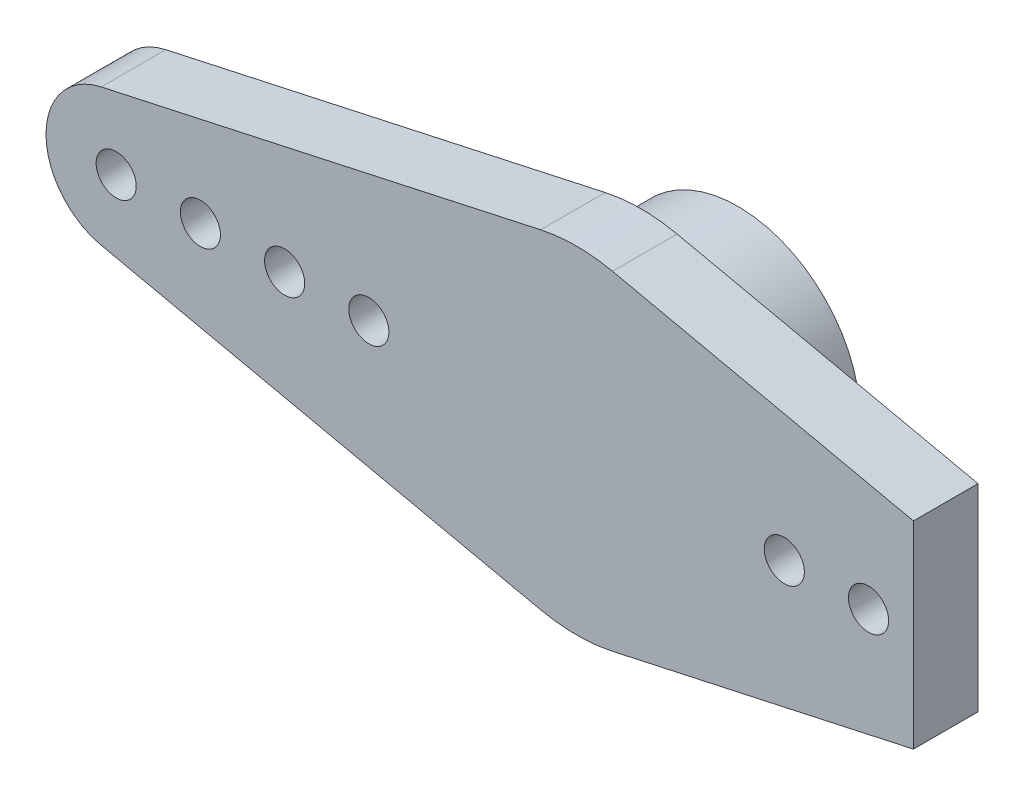
ISO-10303-21;
HEADER;
FILE_DESCRIPTION(('STEP AP214'),'2;1');
FILE_NAME('part.step','',(''),(''),'','','');
FILE_SCHEMA(('AUTOMOTIVE_DESIGN { 1 0 10303 214 1 1 1 1 }'));
ENDSEC;
DATA;
#1=APPLICATION_CONTEXT('core data for automotive mechanical design processes');
#2=APPLICATION_PROTOCOL_DEFINITION('international standard','automotive_design',2000,#1);
#3=PRODUCT_CONTEXT('',#1,'mechanical');
#4=PRODUCT('Part','Part','',(#3));
#5=PRODUCT_RELATED_PRODUCT_CATEGORY('part','',(#4));
#6=PRODUCT_DEFINITION_FORMATION('','',#4);
#7=PRODUCT_DEFINITION_CONTEXT('part definition',#1,'design');
#8=PRODUCT_DEFINITION('design','',#6,#7);
#9=PRODUCT_DEFINITION_SHAPE('','',#8);
#10=(LENGTH_UNIT() NAMED_UNIT(*) SI_UNIT(.MILLI.,.METRE.));
#11=(NAMED_UNIT(*) PLANE_ANGLE_UNIT() SI_UNIT($,.RADIAN.));
#12=(NAMED_UNIT(*) SI_UNIT($,.STERADIAN.) SOLID_ANGLE_UNIT());
#13=UNCERTAINTY_MEASURE_WITH_UNIT(LENGTH_MEASURE(1.E-05),#10,'distance_accuracy_value','');
#14=(GEOMETRIC_REPRESENTATION_CONTEXT(3) GLOBAL_UNCERTAINTY_ASSIGNED_CONTEXT((#13)) GLOBAL_UNIT_ASSIGNED_CONTEXT((#10,
#11,#12)) REPRESENTATION_CONTEXT('',''));
#15=CARTESIAN_POINT('',(0.,0.,0.));
#16=DIRECTION('',(0.,0.,1.));
#17=DIRECTION('',(1.,0.,0.));
#18=AXIS2_PLACEMENT_3D('',#15,#16,#17);
#19=CARTESIAN_POINT('',(0.,0.,3.45));
#20=DIRECTION('',(0.,0.,-1.));
#21=DIRECTION('',(-1.,0.,0.));
#22=AXIS2_PLACEMENT_3D('',#19,#20,#21);
#23=CYLINDRICAL_SURFACE('',#22,4.35);
#24=CARTESIAN_POINT('',(0.,0.,3.45));
#25=DIRECTION('',(0.,0.,1.));
#26=DIRECTION('',(1.,0.,0.));
#27=AXIS2_PLACEMENT_3D('',#24,#25,#26);
#28=CIRCLE('',#27,4.35);
#29=CARTESIAN_POINT('',(4.35,0.,3.45));
#30=VERTEX_POINT('',#29);
#31=EDGE_CURVE('E42',#30,#30,#28,.T.);
#32=ORIENTED_EDGE('',*,*,#31,.F.);
#33=EDGE_LOOP('',(#32));
#34=FACE_BOUND('',#33,.T.);
#35=CARTESIAN_POINT('',(0.,0.,0.));
#36=DIRECTION('',(0.,0.,1.));
#37=DIRECTION('',(1.,0.,0.));
#38=AXIS2_PLACEMENT_3D('',#35,#36,#37);
#39=CIRCLE('',#38,4.35);
#40=CARTESIAN_POINT('',(4.35,0.,0.));
#41=VERTEX_POINT('',#40);
#42=EDGE_CURVE('E160',#41,#41,#39,.T.);
#43=ORIENTED_EDGE('',*,*,#42,.T.);
#44=EDGE_LOOP('',(#43));
#45=FACE_BOUND('',#44,.T.);
#46=ADVANCED_FACE('F35',(#34,#45),#23,.T.);
#47=CARTESIAN_POINT('',(0.,0.,0.));
#48=DIRECTION('',(0.,0.,1.));
#49=DIRECTION('',(1.,0.,0.));
#50=AXIS2_PLACEMENT_3D('',#47,#48,#49);
#51=PLANE('',#50);
#52=CARTESIAN_POINT('',(0.,0.,0.));
#53=DIRECTION('',(0.,0.,-1.));
#54=DIRECTION('',(-1.,0.,0.));
#55=AXIS2_PLACEMENT_3D('',#52,#53,#54);
#56=CIRCLE('',#55,2.85);
#57=CARTESIAN_POINT('',(-2.85,0.,0.));
#58=VERTEX_POINT('',#57);
#59=EDGE_CURVE('E359',#58,#58,#56,.T.);
#60=ORIENTED_EDGE('',*,*,#59,.F.);
#61=EDGE_LOOP('',(#60));
#62=FACE_BOUND('',#61,.T.);
#63=ORIENTED_EDGE('',*,*,#42,.F.);
#64=EDGE_LOOP('',(#63));
#65=FACE_BOUND('',#64,.T.);
#66=ADVANCED_FACE('F166',(#62,#65),#51,.F.);
#67=CARTESIAN_POINT('',(0.,0.,5.75));
#68=DIRECTION('',(0.,0.,1.));
#69=DIRECTION('',(1.,0.,0.));
#70=AXIS2_PLACEMENT_3D('',#67,#68,#69);
#71=PLANE('',#70);
#72=DIRECTION('',(0.,-1.,0.));
#73=VECTOR('',#72,1.);
#74=CARTESIAN_POINT('',(12.,-5.85640708743976,5.75));
#75=LINE('',#74,#73);
#76=CARTESIAN_POINT('',(12.,3.52012196076709,5.75));
#77=VERTEX_POINT('',#76);
#78=CARTESIAN_POINT('',(12.,-3.5201219607671,5.75));
#79=VERTEX_POINT('',#78);
#80=EDGE_CURVE('E412',#77,#79,#75,.T.);
#81=ORIENTED_EDGE('',*,*,#80,.F.);
#82=DIRECTION('',(-0.976961715694215,0.213414634146342,0.));
#83=VECTOR('',#82,1.);
#84=CARTESIAN_POINT('',(1.28048780487805,5.86177029416529,5.75));
#85=LINE('',#84,#83);
#86=CARTESIAN_POINT('',(1.28048780487805,5.86177029416529,5.75));
#87=VERTEX_POINT('',#86);
#88=EDGE_CURVE('E57',#77,#87,#85,.T.);
#89=ORIENTED_EDGE('',*,*,#88,.T.);
#90=CARTESIAN_POINT('',(0.,0.,5.75));
#91=DIRECTION('',(0.,0.,1.));
#92=DIRECTION('',(1.,0.,0.));
#93=AXIS2_PLACEMENT_3D('',#90,#91,#92);
#94=CIRCLE('',#93,6.);
#95=CARTESIAN_POINT('',(-1.28048780487805,5.86177029416529,5.75));
#96=VERTEX_POINT('',#95);
#97=EDGE_CURVE('E151',#87,#96,#94,.T.);
#98=ORIENTED_EDGE('',*,*,#97,.T.);
#99=DIRECTION('',(-0.976961715694215,-0.213414634146342,0.));
#100=VECTOR('',#99,1.);
#101=CARTESIAN_POINT('',(-1.28048780487805,5.86177029416529,5.75));
#102=LINE('',#101,#100);
#103=CARTESIAN_POINT('',(-16.9335365853659,2.44240428923553,5.75));
#104=VERTEX_POINT('',#103);
#105=EDGE_CURVE('E93',#96,#104,#102,.T.);
#106=ORIENTED_EDGE('',*,*,#105,.T.);
#107=CARTESIAN_POINT('',(-16.4,0.,5.75));
#108=DIRECTION('',(0.,0.,1.));
#109=DIRECTION('',(1.,0.,0.));
#110=AXIS2_PLACEMENT_3D('',#107,#108,#109);
#111=CIRCLE('',#110,2.5);
#112=CARTESIAN_POINT('',(-16.9335365853659,-2.44240428923554,5.75));
#113=VERTEX_POINT('',#112);
#114=EDGE_CURVE('E111',#104,#113,#111,.T.);
#115=ORIENTED_EDGE('',*,*,#114,.T.);
#116=DIRECTION('',(0.976961715694215,-0.213414634146341,0.));
#117=VECTOR('',#116,1.);
#118=CARTESIAN_POINT('',(-1.28048780487805,-5.86177029416529,5.75));
#119=LINE('',#118,#117);
#120=CARTESIAN_POINT('',(-1.28048780487805,-5.86177029416529,5.75));
#121=VERTEX_POINT('',#120);
#122=EDGE_CURVE('E102',#113,#121,#119,.T.);
#123=ORIENTED_EDGE('',*,*,#122,.T.);
#124=CARTESIAN_POINT('',(0.,0.,5.75));
#125=DIRECTION('',(0.,0.,1.));
#126=DIRECTION('',(1.,0.,0.));
#127=AXIS2_PLACEMENT_3D('',#124,#125,#126);
#128=CIRCLE('',#127,6.);
#129=CARTESIAN_POINT('',(1.28048780487805,-5.86177029416529,5.75));
#130=VERTEX_POINT('',#129);
#131=EDGE_CURVE('E108',#121,#130,#128,.T.);
#132=ORIENTED_EDGE('',*,*,#131,.T.);
#133=DIRECTION('',(0.976961715694215,0.213414634146341,0.));
#134=VECTOR('',#133,1.);
#135=CARTESIAN_POINT('',(1.28048780487805,-5.86177029416529,5.75));
#136=LINE('',#135,#134);
#137=EDGE_CURVE('E129',#130,#79,#136,.T.);
#138=ORIENTED_EDGE('',*,*,#137,.T.);
#139=EDGE_LOOP('',(#81,#89,#98,#106,#115,#123,#132,#138));
#140=FACE_BOUND('',#139,.T.);
#141=CARTESIAN_POINT('',(7.4,0.,5.75));
#142=DIRECTION('',(0.,0.,1.));
#143=DIRECTION('',(-1.,0.,0.));
#144=AXIS2_PLACEMENT_3D('',#141,#142,#143);
#145=CIRCLE('',#144,0.715);
#146=CARTESIAN_POINT('',(6.685,0.,5.75));
#147=VERTEX_POINT('',#146);
#148=EDGE_CURVE('E373',#147,#147,#145,.T.);
#149=ORIENTED_EDGE('',*,*,#148,.F.);
#150=EDGE_LOOP('',(#149));
#151=FACE_BOUND('',#150,.T.);
#152=CARTESIAN_POINT('',(-7.4,0.,5.75));
#153=DIRECTION('',(0.,0.,1.));
#154=DIRECTION('',(1.,0.,0.));
#155=AXIS2_PLACEMENT_3D('',#152,#153,#154);
#156=CIRCLE('',#155,0.715);
#157=CARTESIAN_POINT('',(-6.685,0.,5.75));
#158=VERTEX_POINT('',#157);
#159=EDGE_CURVE('E385',#158,#158,#156,.T.);
#160=ORIENTED_EDGE('',*,*,#159,.F.);
#161=EDGE_LOOP('',(#160));
#162=FACE_BOUND('',#161,.T.);
#163=CARTESIAN_POINT('',(-16.4,0.,5.75));
#164=DIRECTION('',(0.,0.,1.));
#165=DIRECTION('',(1.,0.,0.));
#166=AXIS2_PLACEMENT_3D('',#163,#164,#165);
#167=CIRCLE('',#166,0.715);
#168=CARTESIAN_POINT('',(-15.685,0.,5.75));
#169=VERTEX_POINT('',#168);
#170=EDGE_CURVE('E140',#169,#169,#167,.T.);
#171=ORIENTED_EDGE('',*,*,#170,.F.);
#172=EDGE_LOOP('',(#171));
#173=FACE_BOUND('',#172,.T.);
#174=CARTESIAN_POINT('',(-13.4,0.,5.75));
#175=DIRECTION('',(0.,0.,1.));
#176=DIRECTION('',(1.,0.,0.));
#177=AXIS2_PLACEMENT_3D('',#174,#175,#176);
#178=CIRCLE('',#177,0.715);
#179=CARTESIAN_POINT('',(-12.685,0.,5.75));
#180=VERTEX_POINT('',#179);
#181=EDGE_CURVE('E391',#180,#180,#178,.T.);
#182=ORIENTED_EDGE('',*,*,#181,.F.);
#183=EDGE_LOOP('',(#182));
#184=FACE_BOUND('',#183,.T.);
#185=CARTESIAN_POINT('',(-10.4,0.,5.75));
#186=DIRECTION('',(0.,0.,1.));
#187=DIRECTION('',(1.,0.,0.));
#188=AXIS2_PLACEMENT_3D('',#185,#186,#187);
#189=CIRCLE('',#188,0.715);
#190=CARTESIAN_POINT('',(-9.685,0.,5.75));
#191=VERTEX_POINT('',#190);
#192=EDGE_CURVE('E379',#191,#191,#189,.T.);
#193=ORIENTED_EDGE('',*,*,#192,.F.);
#194=EDGE_LOOP('',(#193));
#195=FACE_BOUND('',#194,.T.);
#196=CARTESIAN_POINT('',(10.4,0.,5.75));
#197=DIRECTION('',(0.,0.,1.));
#198=DIRECTION('',(-1.,0.,0.));
#199=AXIS2_PLACEMENT_3D('',#196,#197,#198);
#200=CIRCLE('',#199,0.715);
#201=CARTESIAN_POINT('',(9.685,0.,5.75));
#202=VERTEX_POINT('',#201);
#203=EDGE_CURVE('E362',#202,#202,#200,.T.);
#204=ORIENTED_EDGE('',*,*,#203,.F.);
#205=EDGE_LOOP('',(#204));
#206=FACE_BOUND('',#205,.T.);
#207=ADVANCED_FACE('F104',(#140,#151,#162,#173,#184,#195,#206),#71,.T.);
#208=CARTESIAN_POINT('',(0.,0.,3.45));
#209=DIRECTION('',(0.,0.,1.));
#210=DIRECTION('',(1.,0.,0.));
#211=AXIS2_PLACEMENT_3D('',#208,#209,#210);
#212=PLANE('',#211);
#213=ORIENTED_EDGE('',*,*,#31,.T.);
#214=EDGE_LOOP('',(#213));
#215=FACE_BOUND('',#214,.T.);
#216=DIRECTION('',(-0.976961715694215,0.213414634146342,0.));
#217=VECTOR('',#216,1.);
#218=CARTESIAN_POINT('',(1.28048780487805,5.86177029416529,3.45));
#219=LINE('',#218,#217);
#220=CARTESIAN_POINT('',(12.,3.52012196076709,3.45));
#221=VERTEX_POINT('',#220);
#222=CARTESIAN_POINT('',(1.28048780487805,5.86177029416529,3.45));
#223=VERTEX_POINT('',#222);
#224=EDGE_CURVE('E84',#221,#223,#219,.T.);
#225=ORIENTED_EDGE('',*,*,#224,.F.);
#226=DIRECTION('',(0.,-1.,0.));
#227=VECTOR('',#226,1.);
#228=CARTESIAN_POINT('',(12.,0.,3.45));
#229=LINE('',#228,#227);
#230=CARTESIAN_POINT('',(12.,-3.5201219607671,3.45));
#231=VERTEX_POINT('',#230);
#232=EDGE_CURVE('E49',#221,#231,#229,.T.);
#233=ORIENTED_EDGE('',*,*,#232,.T.);
#234=DIRECTION('',(0.976961715694215,0.213414634146341,0.));
#235=VECTOR('',#234,1.);
#236=CARTESIAN_POINT('',(1.28048780487805,-5.86177029416529,3.45));
#237=LINE('',#236,#235);
#238=CARTESIAN_POINT('',(1.28048780487805,-5.86177029416529,3.45));
#239=VERTEX_POINT('',#238);
#240=EDGE_CURVE('E147',#239,#231,#237,.T.);
#241=ORIENTED_EDGE('',*,*,#240,.F.);
#242=CARTESIAN_POINT('',(0.,0.,3.45));
#243=DIRECTION('',(0.,0.,1.));
#244=DIRECTION('',(1.,0.,0.));
#245=AXIS2_PLACEMENT_3D('',#242,#243,#244);
#246=CIRCLE('',#245,6.);
#247=CARTESIAN_POINT('',(-1.28048780487805,-5.86177029416529,3.45));
#248=VERTEX_POINT('',#247);
#249=EDGE_CURVE('E145',#248,#239,#246,.T.);
#250=ORIENTED_EDGE('',*,*,#249,.F.);
#251=DIRECTION('',(0.976961715694215,-0.213414634146341,0.));
#252=VECTOR('',#251,1.);
#253=CARTESIAN_POINT('',(-1.28048780487805,-5.86177029416529,3.45));
#254=LINE('',#253,#252);
#255=CARTESIAN_POINT('',(-16.9335365853659,-2.44240428923554,3.45));
#256=VERTEX_POINT('',#255);
#257=EDGE_CURVE('E120',#256,#248,#254,.T.);
#258=ORIENTED_EDGE('',*,*,#257,.F.);
#259=CARTESIAN_POINT('',(-16.4,0.,3.45));
#260=DIRECTION('',(0.,0.,1.));
#261=DIRECTION('',(1.,0.,0.));
#262=AXIS2_PLACEMENT_3D('',#259,#260,#261);
#263=CIRCLE('',#262,2.5);
#264=CARTESIAN_POINT('',(-16.9335365853659,2.44240428923553,3.45));
#265=VERTEX_POINT('',#264);
#266=EDGE_CURVE('E142',#265,#256,#263,.T.);
#267=ORIENTED_EDGE('',*,*,#266,.F.);
#268=DIRECTION('',(-0.976961715694215,-0.213414634146342,0.));
#269=VECTOR('',#268,1.);
#270=CARTESIAN_POINT('',(-1.28048780487805,5.86177029416529,3.45));
#271=LINE('',#270,#269);
#272=CARTESIAN_POINT('',(-1.28048780487805,5.86177029416529,3.45));
#273=VERTEX_POINT('',#272);
#274=EDGE_CURVE('E139',#273,#265,#271,.T.);
#275=ORIENTED_EDGE('',*,*,#274,.F.);
#276=CARTESIAN_POINT('',(0.,0.,3.45));
#277=DIRECTION('',(0.,0.,1.));
#278=DIRECTION('',(1.,0.,0.));
#279=AXIS2_PLACEMENT_3D('',#276,#277,#278);
#280=CIRCLE('',#279,6.);
#281=EDGE_CURVE('E136',#223,#273,#280,.T.);
#282=ORIENTED_EDGE('',*,*,#281,.F.);
#283=EDGE_LOOP('',(#225,#233,#241,#250,#258,#267,#275,#282));
#284=FACE_BOUND('',#283,.T.);
#285=CARTESIAN_POINT('',(-16.4,0.,3.45));
#286=DIRECTION('',(0.,0.,1.));
#287=DIRECTION('',(1.,0.,0.));
#288=AXIS2_PLACEMENT_3D('',#285,#286,#287);
#289=CIRCLE('',#288,0.715);
#290=CARTESIAN_POINT('',(-15.685,0.,3.45));
#291=VERTEX_POINT('',#290);
#292=EDGE_CURVE('E394',#291,#291,#289,.T.);
#293=ORIENTED_EDGE('',*,*,#292,.T.);
#294=EDGE_LOOP('',(#293));
#295=FACE_BOUND('',#294,.T.);
#296=CARTESIAN_POINT('',(-13.4,0.,3.45));
#297=DIRECTION('',(0.,0.,1.));
#298=DIRECTION('',(1.,0.,0.));
#299=AXIS2_PLACEMENT_3D('',#296,#297,#298);
#300=CIRCLE('',#299,0.715);
#301=CARTESIAN_POINT('',(-12.685,0.,3.45));
#302=VERTEX_POINT('',#301);
#303=EDGE_CURVE('E388',#302,#302,#300,.T.);
#304=ORIENTED_EDGE('',*,*,#303,.T.);
#305=EDGE_LOOP('',(#304));
#306=FACE_BOUND('',#305,.T.);
#307=CARTESIAN_POINT('',(-7.4,0.,3.45));
#308=DIRECTION('',(0.,0.,1.));
#309=DIRECTION('',(1.,0.,0.));
#310=AXIS2_PLACEMENT_3D('',#307,#308,#309);
#311=CIRCLE('',#310,0.715);
#312=CARTESIAN_POINT('',(-6.685,0.,3.45));
#313=VERTEX_POINT('',#312);
#314=EDGE_CURVE('E382',#313,#313,#311,.T.);
#315=ORIENTED_EDGE('',*,*,#314,.T.);
#316=EDGE_LOOP('',(#315));
#317=FACE_BOUND('',#316,.T.);
#318=CARTESIAN_POINT('',(-10.4,0.,3.45));
#319=DIRECTION('',(0.,0.,1.));
#320=DIRECTION('',(1.,0.,0.));
#321=AXIS2_PLACEMENT_3D('',#318,#319,#320);
#322=CIRCLE('',#321,0.715);
#323=CARTESIAN_POINT('',(-9.685,0.,3.45));
#324=VERTEX_POINT('',#323);
#325=EDGE_CURVE('E376',#324,#324,#322,.T.);
#326=ORIENTED_EDGE('',*,*,#325,.T.);
#327=EDGE_LOOP('',(#326));
#328=FACE_BOUND('',#327,.T.);
#329=CARTESIAN_POINT('',(7.4,0.,3.45));
#330=DIRECTION('',(0.,0.,1.));
#331=DIRECTION('',(-1.,0.,0.));
#332=AXIS2_PLACEMENT_3D('',#329,#330,#331);
#333=CIRCLE('',#332,0.715);
#334=CARTESIAN_POINT('',(6.685,0.,3.45));
#335=VERTEX_POINT('',#334);
#336=EDGE_CURVE('E371',#335,#335,#333,.T.);
#337=ORIENTED_EDGE('',*,*,#336,.T.);
#338=EDGE_LOOP('',(#337));
#339=FACE_BOUND('',#338,.T.);
#340=CARTESIAN_POINT('',(10.4,0.,3.45));
#341=DIRECTION('',(0.,0.,1.));
#342=DIRECTION('',(-1.,0.,0.));
#343=AXIS2_PLACEMENT_3D('',#340,#341,#342);
#344=CIRCLE('',#343,0.715);
#345=CARTESIAN_POINT('',(9.685,0.,3.45));
#346=VERTEX_POINT('',#345);
#347=EDGE_CURVE('E358',#346,#346,#344,.T.);
#348=ORIENTED_EDGE('',*,*,#347,.T.);
#349=EDGE_LOOP('',(#348));
#350=FACE_BOUND('',#349,.T.);
#351=ADVANCED_FACE('F174',(#215,#284,#295,#306,#317,#328,#339,#350),#212,.F.);
#352=CARTESIAN_POINT('',(0.,0.,5.75));
#353=DIRECTION('',(0.,0.,-1.));
#354=DIRECTION('',(-1.,0.,0.));
#355=AXIS2_PLACEMENT_3D('',#352,#353,#354);
#356=CYLINDRICAL_SURFACE('',#355,6.);
#357=ORIENTED_EDGE('',*,*,#281,.T.);
#358=DIRECTION('',(0.,0.,-1.));
#359=VECTOR('',#358,1.);
#360=CARTESIAN_POINT('',(-1.28048780487805,5.86177029416529,5.75));
#361=LINE('',#360,#359);
#362=EDGE_CURVE('E158',#96,#273,#361,.T.);
#363=ORIENTED_EDGE('',*,*,#362,.F.);
#364=ORIENTED_EDGE('',*,*,#97,.F.);
#365=DIRECTION('',(0.,0.,-1.));
#366=VECTOR('',#365,1.);
#367=CARTESIAN_POINT('',(1.28048780487805,5.86177029416529,5.75));
#368=LINE('',#367,#366);
#369=EDGE_CURVE('E135',#87,#223,#368,.T.);
#370=ORIENTED_EDGE('',*,*,#369,.T.);
#371=EDGE_LOOP('',(#357,#363,#364,#370));
#372=FACE_BOUND('',#371,.T.);
#373=ADVANCED_FACE('F179',(#372),#356,.T.);
#374=CARTESIAN_POINT('',(-1.28048780487805,5.86177029416529,5.75));
#375=DIRECTION('',(0.213414634146342,-0.976961715694215,0.));
#376=DIRECTION('',(0.976961715694215,0.213414634146342,0.));
#377=AXIS2_PLACEMENT_3D('',#374,#375,#376);
#378=PLANE('',#377);
#379=ORIENTED_EDGE('',*,*,#274,.T.);
#380=DIRECTION('',(0.,0.,-1.));
#381=VECTOR('',#380,1.);
#382=CARTESIAN_POINT('',(-16.9335365853659,2.44240428923553,5.75));
#383=LINE('',#382,#381);
#384=EDGE_CURVE('E155',#104,#265,#383,.T.);
#385=ORIENTED_EDGE('',*,*,#384,.F.);
#386=ORIENTED_EDGE('',*,*,#105,.F.);
#387=ORIENTED_EDGE('',*,*,#362,.T.);
#388=EDGE_LOOP('',(#379,#385,#386,#387));
#389=FACE_BOUND('',#388,.T.);
#390=ADVANCED_FACE('F182',(#389),#378,.F.);
#391=CARTESIAN_POINT('',(-16.4,0.,5.75));
#392=DIRECTION('',(0.,0.,-1.));
#393=DIRECTION('',(-1.,0.,0.));
#394=AXIS2_PLACEMENT_3D('',#391,#392,#393);
#395=CYLINDRICAL_SURFACE('',#394,2.5);
#396=ORIENTED_EDGE('',*,*,#266,.T.);
#397=DIRECTION('',(0.,0.,-1.));
#398=VECTOR('',#397,1.);
#399=CARTESIAN_POINT('',(-16.9335365853659,-2.44240428923554,5.75));
#400=LINE('',#399,#398);
#401=EDGE_CURVE('E123',#113,#256,#400,.T.);
#402=ORIENTED_EDGE('',*,*,#401,.F.);
#403=ORIENTED_EDGE('',*,*,#114,.F.);
#404=ORIENTED_EDGE('',*,*,#384,.T.);
#405=EDGE_LOOP('',(#396,#402,#403,#404));
#406=FACE_BOUND('',#405,.T.);
#407=ADVANCED_FACE('F186',(#406),#395,.T.);
#408=CARTESIAN_POINT('',(-1.28048780487805,-5.86177029416529,5.75));
#409=DIRECTION('',(0.213414634146341,0.976961715694214,0.));
#410=DIRECTION('',(-0.976961715694215,0.213414634146341,0.));
#411=AXIS2_PLACEMENT_3D('',#408,#409,#410);
#412=PLANE('',#411);
#413=ORIENTED_EDGE('',*,*,#257,.T.);
#414=DIRECTION('',(0.,0.,-1.));
#415=VECTOR('',#414,1.);
#416=CARTESIAN_POINT('',(-1.28048780487805,-5.86177029416529,5.75));
#417=LINE('',#416,#415);
#418=EDGE_CURVE('E117',#121,#248,#417,.T.);
#419=ORIENTED_EDGE('',*,*,#418,.F.);
#420=ORIENTED_EDGE('',*,*,#122,.F.);
#421=ORIENTED_EDGE('',*,*,#401,.T.);
#422=EDGE_LOOP('',(#413,#419,#420,#421));
#423=FACE_BOUND('',#422,.T.);
#424=ADVANCED_FACE('F118',(#423),#412,.F.);
#425=CARTESIAN_POINT('',(0.,0.,5.75));
#426=DIRECTION('',(0.,0.,-1.));
#427=DIRECTION('',(-1.,0.,0.));
#428=AXIS2_PLACEMENT_3D('',#425,#426,#427);
#429=CYLINDRICAL_SURFACE('',#428,6.);
#430=ORIENTED_EDGE('',*,*,#249,.T.);
#431=DIRECTION('',(0.,0.,-1.));
#432=VECTOR('',#431,1.);
#433=CARTESIAN_POINT('',(1.28048780487805,-5.86177029416529,5.75));
#434=LINE('',#433,#432);
#435=EDGE_CURVE('E124',#130,#239,#434,.T.);
#436=ORIENTED_EDGE('',*,*,#435,.F.);
#437=ORIENTED_EDGE('',*,*,#131,.F.);
#438=ORIENTED_EDGE('',*,*,#418,.T.);
#439=EDGE_LOOP('',(#430,#436,#437,#438));
#440=FACE_BOUND('',#439,.T.);
#441=ADVANCED_FACE('F126',(#440),#429,.T.);
#442=CARTESIAN_POINT('',(1.28048780487805,-5.86177029416529,5.75));
#443=DIRECTION('',(-0.213414634146341,0.976961715694214,0.));
#444=DIRECTION('',(-0.976961715694215,-0.213414634146341,0.));
#445=AXIS2_PLACEMENT_3D('',#442,#443,#444);
#446=PLANE('',#445);
#447=ORIENTED_EDGE('',*,*,#240,.T.);
#448=DIRECTION('',(0.,0.,1.));
#449=VECTOR('',#448,1.);
#450=CARTESIAN_POINT('',(12.,-3.5201219607671,5.75));
#451=LINE('',#450,#449);
#452=EDGE_CURVE('E365',#231,#79,#451,.T.);
#453=ORIENTED_EDGE('',*,*,#452,.T.);
#454=ORIENTED_EDGE('',*,*,#137,.F.);
#455=ORIENTED_EDGE('',*,*,#435,.T.);
#456=EDGE_LOOP('',(#447,#453,#454,#455));
#457=FACE_BOUND('',#456,.T.);
#458=ADVANCED_FACE('F194',(#457),#446,.F.);
#459=CARTESIAN_POINT('',(1.28048780487805,5.86177029416529,5.75));
#460=DIRECTION('',(-0.213414634146342,-0.976961715694215,0.));
#461=DIRECTION('',(0.976961715694215,-0.213414634146342,0.));
#462=AXIS2_PLACEMENT_3D('',#459,#460,#461);
#463=PLANE('',#462);
#464=ORIENTED_EDGE('',*,*,#88,.F.);
#465=DIRECTION('',(0.,0.,-1.));
#466=VECTOR('',#465,1.);
#467=CARTESIAN_POINT('',(12.,3.52012196076709,5.75));
#468=LINE('',#467,#466);
#469=EDGE_CURVE('E11',#77,#221,#468,.T.);
#470=ORIENTED_EDGE('',*,*,#469,.T.);
#471=ORIENTED_EDGE('',*,*,#224,.T.);
#472=ORIENTED_EDGE('',*,*,#369,.F.);
#473=EDGE_LOOP('',(#464,#470,#471,#472));
#474=FACE_BOUND('',#473,.T.);
#475=ADVANCED_FACE('F197',(#474),#463,.F.);
#476=CARTESIAN_POINT('',(-16.4,0.,5.75));
#477=DIRECTION('',(0.,0.,-1.));
#478=DIRECTION('',(-1.,0.,0.));
#479=AXIS2_PLACEMENT_3D('',#476,#477,#478);
#480=CYLINDRICAL_SURFACE('',#479,0.715);
#481=ORIENTED_EDGE('',*,*,#170,.T.);
#482=EDGE_LOOP('',(#481));
#483=FACE_BOUND('',#482,.T.);
#484=ORIENTED_EDGE('',*,*,#292,.F.);
#485=EDGE_LOOP('',(#484));
#486=FACE_BOUND('',#485,.T.);
#487=ADVANCED_FACE('F201',(#483,#486),#480,.F.);
#488=CARTESIAN_POINT('',(-13.4,0.,5.75));
#489=DIRECTION('',(0.,0.,-1.));
#490=DIRECTION('',(-1.,0.,0.));
#491=AXIS2_PLACEMENT_3D('',#488,#489,#490);
#492=CYLINDRICAL_SURFACE('',#491,0.715);
#493=ORIENTED_EDGE('',*,*,#181,.T.);
#494=EDGE_LOOP('',(#493));
#495=FACE_BOUND('',#494,.T.);
#496=ORIENTED_EDGE('',*,*,#303,.F.);
#497=EDGE_LOOP('',(#496));
#498=FACE_BOUND('',#497,.T.);
#499=ADVANCED_FACE('F207',(#495,#498),#492,.F.);
#500=CARTESIAN_POINT('',(-7.4,0.,5.75));
#501=DIRECTION('',(0.,0.,-1.));
#502=DIRECTION('',(-1.,0.,0.));
#503=AXIS2_PLACEMENT_3D('',#500,#501,#502);
#504=CYLINDRICAL_SURFACE('',#503,0.715);
#505=ORIENTED_EDGE('',*,*,#159,.T.);
#506=EDGE_LOOP('',(#505));
#507=FACE_BOUND('',#506,.T.);
#508=ORIENTED_EDGE('',*,*,#314,.F.);
#509=EDGE_LOOP('',(#508));
#510=FACE_BOUND('',#509,.T.);
#511=ADVANCED_FACE('F211',(#507,#510),#504,.F.);
#512=CARTESIAN_POINT('',(-10.4,0.,5.75));
#513=DIRECTION('',(0.,0.,-1.));
#514=DIRECTION('',(-1.,0.,0.));
#515=AXIS2_PLACEMENT_3D('',#512,#513,#514);
#516=CYLINDRICAL_SURFACE('',#515,0.715);
#517=ORIENTED_EDGE('',*,*,#192,.T.);
#518=EDGE_LOOP('',(#517));
#519=FACE_BOUND('',#518,.T.);
#520=ORIENTED_EDGE('',*,*,#325,.F.);
#521=EDGE_LOOP('',(#520));
#522=FACE_BOUND('',#521,.T.);
#523=ADVANCED_FACE('F215',(#519,#522),#516,.F.);
#524=CARTESIAN_POINT('',(7.4,0.,5.75));
#525=DIRECTION('',(0.,0.,-1.));
#526=DIRECTION('',(-1.,0.,0.));
#527=AXIS2_PLACEMENT_3D('',#524,#525,#526);
#528=CYLINDRICAL_SURFACE('',#527,0.715);
#529=ORIENTED_EDGE('',*,*,#148,.T.);
#530=EDGE_LOOP('',(#529));
#531=FACE_BOUND('',#530,.T.);
#532=ORIENTED_EDGE('',*,*,#336,.F.);
#533=EDGE_LOOP('',(#532));
#534=FACE_BOUND('',#533,.T.);
#535=ADVANCED_FACE('F219',(#531,#534),#528,.F.);
#536=CARTESIAN_POINT('',(10.4,0.,5.75));
#537=DIRECTION('',(0.,0.,-1.));
#538=DIRECTION('',(-1.,0.,0.));
#539=AXIS2_PLACEMENT_3D('',#536,#537,#538);
#540=CYLINDRICAL_SURFACE('',#539,0.715);
#541=ORIENTED_EDGE('',*,*,#203,.T.);
#542=EDGE_LOOP('',(#541));
#543=FACE_BOUND('',#542,.T.);
#544=ORIENTED_EDGE('',*,*,#347,.F.);
#545=EDGE_LOOP('',(#544));
#546=FACE_BOUND('',#545,.T.);
#547=ADVANCED_FACE('F223',(#543,#546),#540,.F.);
#548=CARTESIAN_POINT('',(0.,0.,3.4));
#549=DIRECTION('',(0.,0.,-1.));
#550=DIRECTION('',(-1.,0.,0.));
#551=AXIS2_PLACEMENT_3D('',#548,#549,#550);
#552=CYLINDRICAL_SURFACE('',#551,2.85);
#553=CARTESIAN_POINT('',(0.,0.,3.4));
#554=DIRECTION('',(0.,0.,-1.));
#555=DIRECTION('',(-1.,0.,0.));
#556=AXIS2_PLACEMENT_3D('',#553,#554,#555);
#557=CIRCLE('',#556,2.85);
#558=CARTESIAN_POINT('',(-2.85,0.,3.4));
#559=VERTEX_POINT('',#558);
#560=EDGE_CURVE('E357',#559,#559,#557,.T.);
#561=ORIENTED_EDGE('',*,*,#560,.F.);
#562=EDGE_LOOP('',(#561));
#563=FACE_BOUND('',#562,.T.);
#564=ORIENTED_EDGE('',*,*,#59,.T.);
#565=EDGE_LOOP('',(#564));
#566=FACE_BOUND('',#565,.T.);
#567=ADVANCED_FACE('F227',(#563,#566),#552,.F.);
#568=CARTESIAN_POINT('',(0.,0.,3.4));
#569=DIRECTION('',(0.,0.,-1.));
#570=DIRECTION('',(-1.,0.,0.));
#571=AXIS2_PLACEMENT_3D('',#568,#569,#570);
#572=PLANE('',#571);
#573=ORIENTED_EDGE('',*,*,#560,.T.);
#574=EDGE_LOOP('',(#573));
#575=FACE_BOUND('',#574,.T.);
#576=ADVANCED_FACE('F231',(#575),#572,.T.);
#577=CARTESIAN_POINT('',(12.,-5.85640708743976,-4.25));
#578=DIRECTION('',(-1.,0.,0.));
#579=DIRECTION('',(0.,0.,1.));
#580=AXIS2_PLACEMENT_3D('',#577,#578,#579);
#581=PLANE('',#580);
#582=ORIENTED_EDGE('',*,*,#232,.F.);
#583=ORIENTED_EDGE('',*,*,#469,.F.);
#584=ORIENTED_EDGE('',*,*,#80,.T.);
#585=ORIENTED_EDGE('',*,*,#452,.F.);
#586=EDGE_LOOP('',(#582,#583,#584,#585));
#587=FACE_BOUND('',#586,.T.);
#588=ADVANCED_FACE('F235',(#587),#581,.F.);
#589=CLOSED_SHELL('',(#46,#66,#207,#351,#373,#390,#407,#424,#441,#458,#475,#487,#499,#511,#523,
#535,#547,#567,#576,#588));
#590=MANIFOLD_SOLID_BREP('B2',#589);
#591=ADVANCED_BREP_SHAPE_REPRESENTATION('',(#18,#590),#14);
#592=SHAPE_DEFINITION_REPRESENTATION(#9,#591);
ENDSEC;
END-ISO-10303-21;
